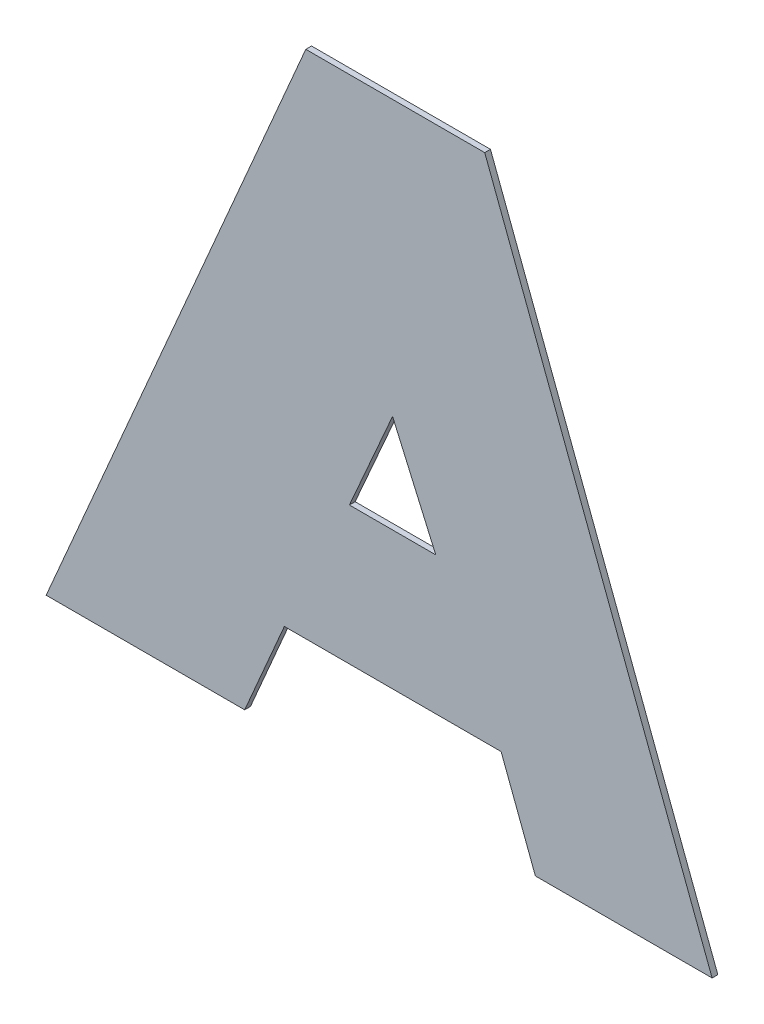
ISO-10303-21;
HEADER;
FILE_DESCRIPTION(('STEP AP214'),'2;1');
FILE_NAME('part.step','',(''),(''),'','','');
FILE_SCHEMA(('AUTOMOTIVE_DESIGN { 1 0 10303 214 1 1 1 1 }'));
ENDSEC;
DATA;
#1=APPLICATION_CONTEXT('core data for automotive mechanical design processes');
#2=APPLICATION_PROTOCOL_DEFINITION('international standard','automotive_design',2000,#1);
#3=PRODUCT_CONTEXT('',#1,'mechanical');
#4=PRODUCT('Part','Part','',(#3));
#5=PRODUCT_RELATED_PRODUCT_CATEGORY('part','',(#4));
#6=PRODUCT_DEFINITION_FORMATION('','',#4);
#7=PRODUCT_DEFINITION_CONTEXT('part definition',#1,'design');
#8=PRODUCT_DEFINITION('design','',#6,#7);
#9=PRODUCT_DEFINITION_SHAPE('','',#8);
#10=(LENGTH_UNIT() NAMED_UNIT(*) SI_UNIT(.MILLI.,.METRE.));
#11=(NAMED_UNIT(*) PLANE_ANGLE_UNIT() SI_UNIT($,.RADIAN.));
#12=(NAMED_UNIT(*) SI_UNIT($,.STERADIAN.) SOLID_ANGLE_UNIT());
#13=UNCERTAINTY_MEASURE_WITH_UNIT(LENGTH_MEASURE(1.E-05),#10,'distance_accuracy_value','');
#14=(GEOMETRIC_REPRESENTATION_CONTEXT(3) GLOBAL_UNCERTAINTY_ASSIGNED_CONTEXT((#13)) GLOBAL_UNIT_ASSIGNED_CONTEXT((#10,
#11,#12)) REPRESENTATION_CONTEXT('',''));
#15=CARTESIAN_POINT('',(0.,0.,0.));
#16=DIRECTION('',(0.,0.,1.));
#17=DIRECTION('',(1.,0.,0.));
#18=AXIS2_PLACEMENT_3D('',#15,#16,#17);
#19=CARTESIAN_POINT('',(0.,1.03768008731782,0.551));
#20=DIRECTION('',(0.,-1.,0.));
#21=DIRECTION('',(0.,0.,-1.));
#22=AXIS2_PLACEMENT_3D('',#19,#20,#21);
#23=PLANE('',#22);
#24=DIRECTION('',(-1.,0.,0.));
#25=VECTOR('',#24,1.);
#26=CARTESIAN_POINT('',(1.05029821951941,1.03768008731782,0.55));
#27=LINE('',#26,#25);
#28=CARTESIAN_POINT('',(1.05029821951941,1.03768008731782,0.55));
#29=VERTEX_POINT('',#28);
#30=CARTESIAN_POINT('',(1.01563203255563,1.03768008731782,0.55));
#31=VERTEX_POINT('',#30);
#32=EDGE_CURVE('E11',#29,#31,#27,.T.);
#33=ORIENTED_EDGE('',*,*,#32,.F.);
#34=DIRECTION('',(0.,0.,-1.));
#35=VECTOR('',#34,1.);
#36=CARTESIAN_POINT('',(1.05029821951941,1.03768008731782,0.551));
#37=LINE('',#36,#35);
#38=CARTESIAN_POINT('',(1.05029821951941,1.03768008731782,0.551));
#39=VERTEX_POINT('',#38);
#40=EDGE_CURVE('E190',#39,#29,#37,.T.);
#41=ORIENTED_EDGE('',*,*,#40,.F.);
#42=DIRECTION('',(-1.,0.,0.));
#43=VECTOR('',#42,1.);
#44=CARTESIAN_POINT('',(1.05029821951941,1.03768008731782,0.551));
#45=LINE('',#44,#43);
#46=CARTESIAN_POINT('',(1.01563203255563,1.03768008731782,0.551));
#47=VERTEX_POINT('',#46);
#48=EDGE_CURVE('E183',#39,#47,#45,.T.);
#49=ORIENTED_EDGE('',*,*,#48,.T.);
#50=DIRECTION('',(0.,0.,-1.));
#51=VECTOR('',#50,1.);
#52=CARTESIAN_POINT('',(1.01563203255563,1.03768008731782,0.551));
#53=LINE('',#52,#51);
#54=EDGE_CURVE('E172',#47,#31,#53,.T.);
#55=ORIENTED_EDGE('',*,*,#54,.T.);
#56=EDGE_LOOP('',(#33,#41,#49,#55));
#57=FACE_BOUND('',#56,.T.);
#58=ADVANCED_FACE('F17',(#57),#23,.T.);
#59=CARTESIAN_POINT('',(0.508733461367942,-0.219202709081923,0.551));
#60=DIRECTION('',(0.918375888718996,-0.395709144473052,0.));
#61=DIRECTION('',(0.395709144473052,0.918375888718996,0.));
#62=AXIS2_PLACEMENT_3D('',#59,#60,#61);
#63=PLANE('',#62);
#64=DIRECTION('',(-0.395709144473054,-0.918375888718995,0.));
#65=VECTOR('',#64,1.);
#66=CARTESIAN_POINT('',(1.05722528503883,1.05375666791109,0.55));
#67=LINE('',#66,#65);
#68=CARTESIAN_POINT('',(1.05722528503883,1.05375666791109,0.55));
#69=VERTEX_POINT('',#68);
#70=EDGE_CURVE('E24',#69,#29,#67,.T.);
#71=ORIENTED_EDGE('',*,*,#70,.F.);
#72=DIRECTION('',(0.,0.,-1.));
#73=VECTOR('',#72,1.);
#74=CARTESIAN_POINT('',(1.05722528503883,1.05375666791109,0.551));
#75=LINE('',#74,#73);
#76=CARTESIAN_POINT('',(1.05722528503883,1.05375666791109,0.551));
#77=VERTEX_POINT('',#76);
#78=EDGE_CURVE('E185',#77,#69,#75,.T.);
#79=ORIENTED_EDGE('',*,*,#78,.F.);
#80=DIRECTION('',(-0.395709144473054,-0.918375888718995,0.));
#81=VECTOR('',#80,1.);
#82=CARTESIAN_POINT('',(1.05722528503883,1.05375666791109,0.551));
#83=LINE('',#82,#81);
#84=EDGE_CURVE('E174',#77,#39,#83,.T.);
#85=ORIENTED_EDGE('',*,*,#84,.T.);
#86=ORIENTED_EDGE('',*,*,#40,.T.);
#87=EDGE_LOOP('',(#71,#79,#85,#86));
#88=FACE_BOUND('',#87,.T.);
#89=ADVANCED_FACE('F205',(#88),#63,.T.);
#90=CARTESIAN_POINT('',(0.,1.0537566679111,0.551));
#91=DIRECTION('',(0.,-1.,0.));
#92=DIRECTION('',(1.,0.,0.));
#93=AXIS2_PLACEMENT_3D('',#90,#91,#92);
#94=PLANE('',#93);
#95=DIRECTION('',(-1.,0.,0.));
#96=VECTOR('',#95,1.);
#97=CARTESIAN_POINT('',(1.09506886804617,1.05375666791109,0.55));
#98=LINE('',#97,#96);
#99=CARTESIAN_POINT('',(1.09506886804617,1.05375666791108,0.55));
#100=VERTEX_POINT('',#99);
#101=EDGE_CURVE('E187',#100,#69,#98,.T.);
#102=ORIENTED_EDGE('',*,*,#101,.F.);
#103=DIRECTION('',(0.,0.,-1.));
#104=VECTOR('',#103,1.);
#105=CARTESIAN_POINT('',(1.09506886804617,1.05375666791108,0.551));
#106=LINE('',#105,#104);
#107=CARTESIAN_POINT('',(1.09506886804617,1.05375666791108,0.551));
#108=VERTEX_POINT('',#107);
#109=EDGE_CURVE('E177',#108,#100,#106,.T.);
#110=ORIENTED_EDGE('',*,*,#109,.F.);
#111=DIRECTION('',(-1.,0.,0.));
#112=VECTOR('',#111,1.);
#113=CARTESIAN_POINT('',(1.09506886804617,1.05375666791109,0.551));
#114=LINE('',#113,#112);
#115=EDGE_CURVE('E163',#108,#77,#114,.T.);
#116=ORIENTED_EDGE('',*,*,#115,.T.);
#117=ORIENTED_EDGE('',*,*,#78,.T.);
#118=EDGE_LOOP('',(#102,#110,#116,#117));
#119=FACE_BOUND('',#118,.T.);
#120=ADVANCED_FACE('F195',(#119),#94,.T.);
#121=CARTESIAN_POINT('',(1.3066986324953,0.494252347521643,0.551));
#122=DIRECTION('',(-0.935327513763568,-0.353783043681946,0.));
#123=DIRECTION('',(0.353783043681946,-0.935327513763568,0.));
#124=AXIS2_PLACEMENT_3D('',#121,#122,#123);
#125=PLANE('',#124);
#126=DIRECTION('',(-0.353783043681943,0.93532751376357,0.));
#127=VECTOR('',#126,1.);
#128=CARTESIAN_POINT('',(1.10105217081462,1.03793808134384,0.55));
#129=LINE('',#128,#127);
#130=CARTESIAN_POINT('',(1.10105217081462,1.03793808134384,0.55));
#131=VERTEX_POINT('',#130);
#132=EDGE_CURVE('E180',#131,#100,#129,.T.);
#133=ORIENTED_EDGE('',*,*,#132,.F.);
#134=DIRECTION('',(0.,-2.22044604925006E-13,-1.));
#135=VECTOR('',#134,1.);
#136=CARTESIAN_POINT('',(1.10105217081462,1.03793808134384,0.551));
#137=LINE('',#136,#135);
#138=CARTESIAN_POINT('',(1.10105217081462,1.03793808134384,0.551));
#139=VERTEX_POINT('',#138);
#140=EDGE_CURVE('E166',#139,#131,#137,.T.);
#141=ORIENTED_EDGE('',*,*,#140,.F.);
#142=DIRECTION('',(-0.353783043681943,0.93532751376357,0.));
#143=VECTOR('',#142,1.);
#144=CARTESIAN_POINT('',(1.10105217081462,1.03793808134384,0.551));
#145=LINE('',#144,#143);
#146=EDGE_CURVE('E154',#139,#108,#145,.T.);
#147=ORIENTED_EDGE('',*,*,#146,.T.);
#148=ORIENTED_EDGE('',*,*,#109,.T.);
#149=EDGE_LOOP('',(#133,#141,#147,#148));
#150=FACE_BOUND('',#149,.T.);
#151=ADVANCED_FACE('F197',(#150),#125,.T.);
#152=CARTESIAN_POINT('',(0.,1.03793808134384,0.551));
#153=DIRECTION('',(0.,-1.,0.));
#154=DIRECTION('',(0.,0.,-1.));
#155=AXIS2_PLACEMENT_3D('',#152,#153,#154);
#156=PLANE('',#155);
#157=DIRECTION('',(-1.,0.,0.));
#158=VECTOR('',#157,1.);
#159=CARTESIAN_POINT('',(1.13191269623935,1.03793808134384,0.55));
#160=LINE('',#159,#158);
#161=CARTESIAN_POINT('',(1.13191269623935,1.03793808134384,0.55));
#162=VERTEX_POINT('',#161);
#163=EDGE_CURVE('E169',#162,#131,#160,.T.);
#164=ORIENTED_EDGE('',*,*,#163,.F.);
#165=DIRECTION('',(0.,-2.22044604925006E-13,-1.));
#166=VECTOR('',#165,1.);
#167=CARTESIAN_POINT('',(1.13191269623935,1.03793808134384,0.551));
#168=LINE('',#167,#166);
#169=CARTESIAN_POINT('',(1.13191269623935,1.03793808134384,0.551));
#170=VERTEX_POINT('',#169);
#171=EDGE_CURVE('E157',#170,#162,#168,.T.);
#172=ORIENTED_EDGE('',*,*,#171,.F.);
#173=DIRECTION('',(-1.,0.,0.));
#174=VECTOR('',#173,1.);
#175=CARTESIAN_POINT('',(1.13191269623935,1.03793808134384,0.551));
#176=LINE('',#175,#174);
#177=EDGE_CURVE('E145',#170,#139,#176,.T.);
#178=ORIENTED_EDGE('',*,*,#177,.T.);
#179=ORIENTED_EDGE('',*,*,#140,.T.);
#180=EDGE_LOOP('',(#164,#172,#178,#179));
#181=FACE_BOUND('',#180,.T.);
#182=ADVANCED_FACE('F217',(#181),#156,.T.);
#183=CARTESIAN_POINT('',(1.33369657919657,0.504464188418624,0.551));
#184=DIRECTION('',(0.935327513763572,0.353783043681937,0.));
#185=DIRECTION('',(-0.353783043681937,0.935327513763572,0.));
#186=AXIS2_PLACEMENT_3D('',#183,#184,#185);
#187=PLANE('',#186);
#188=DIRECTION('',(0.353783043681939,-0.935327513763571,0.));
#189=VECTOR('',#188,1.);
#190=CARTESIAN_POINT('',(1.09221187275809,1.1428986586927,0.55));
#191=LINE('',#190,#189);
#192=CARTESIAN_POINT('',(1.09221187275809,1.1428986586927,0.55));
#193=VERTEX_POINT('',#192);
#194=EDGE_CURVE('E160',#193,#162,#191,.T.);
#195=ORIENTED_EDGE('',*,*,#194,.F.);
#196=DIRECTION('',(0.,-2.22044604925006E-13,-1.));
#197=VECTOR('',#196,1.);
#198=CARTESIAN_POINT('',(1.09221187275809,1.1428986586927,0.551));
#199=LINE('',#198,#197);
#200=CARTESIAN_POINT('',(1.09221187275809,1.1428986586927,0.551));
#201=VERTEX_POINT('',#200);
#202=EDGE_CURVE('E148',#201,#193,#199,.T.);
#203=ORIENTED_EDGE('',*,*,#202,.F.);
#204=DIRECTION('',(0.353783043681939,-0.935327513763571,0.));
#205=VECTOR('',#204,1.);
#206=CARTESIAN_POINT('',(1.09221187275809,1.1428986586927,0.551));
#207=LINE('',#206,#205);
#208=EDGE_CURVE('E137',#201,#170,#207,.T.);
#209=ORIENTED_EDGE('',*,*,#208,.T.);
#210=ORIENTED_EDGE('',*,*,#171,.T.);
#211=EDGE_LOOP('',(#195,#203,#209,#210));
#212=FACE_BOUND('',#211,.T.);
#213=ADVANCED_FACE('F215',(#212),#187,.T.);
#214=CARTESIAN_POINT('',(0.,1.1428986586927,0.551));
#215=DIRECTION('',(0.,1.,0.));
#216=DIRECTION('',(0.,0.,1.));
#217=AXIS2_PLACEMENT_3D('',#214,#215,#216);
#218=PLANE('',#217);
#219=DIRECTION('',(1.,0.,0.));
#220=VECTOR('',#219,1.);
#221=CARTESIAN_POINT('',(1.06096853514991,1.1428986586927,0.55));
#222=LINE('',#221,#220);
#223=CARTESIAN_POINT('',(1.06096853514991,1.1428986586927,0.55));
#224=VERTEX_POINT('',#223);
#225=EDGE_CURVE('E151',#224,#193,#222,.T.);
#226=ORIENTED_EDGE('',*,*,#225,.F.);
#227=DIRECTION('',(0.,-2.22044604925006E-13,-1.));
#228=VECTOR('',#227,1.);
#229=CARTESIAN_POINT('',(1.06096853514991,1.1428986586927,0.551));
#230=LINE('',#229,#228);
#231=CARTESIAN_POINT('',(1.06096853514991,1.1428986586927,0.551));
#232=VERTEX_POINT('',#231);
#233=EDGE_CURVE('E140',#232,#224,#230,.T.);
#234=ORIENTED_EDGE('',*,*,#233,.F.);
#235=DIRECTION('',(1.,0.,0.));
#236=VECTOR('',#235,1.);
#237=CARTESIAN_POINT('',(1.06096853514991,1.1428986586927,0.551));
#238=LINE('',#237,#236);
#239=EDGE_CURVE('E130',#232,#201,#238,.T.);
#240=ORIENTED_EDGE('',*,*,#239,.T.);
#241=ORIENTED_EDGE('',*,*,#202,.T.);
#242=EDGE_LOOP('',(#226,#234,#240,#241));
#243=FACE_BOUND('',#242,.T.);
#244=ADVANCED_FACE('F213',(#243),#218,.T.);
#245=CARTESIAN_POINT('',(0.498977099105884,-0.219145347580263,0.551));
#246=DIRECTION('',(0.915588482621426,-0.402116563313419,0.));
#247=DIRECTION('',(0.402116563313419,0.915588482621426,0.));
#248=AXIS2_PLACEMENT_3D('',#245,#246,#247);
#249=PLANE('',#248);
#250=DIRECTION('',(-0.402116563313421,-0.915588482621425,0.));
#251=VECTOR('',#250,1.);
#252=CARTESIAN_POINT('',(1.0761201152762,1.09496490462305,0.55));
#253=LINE('',#252,#251);
#254=CARTESIAN_POINT('',(1.0761201152762,1.09496490462305,0.55));
#255=VERTEX_POINT('',#254);
#256=CARTESIAN_POINT('',(1.068579889768,1.07779639115823,0.55));
#257=VERTEX_POINT('',#256);
#258=EDGE_CURVE('E143',#255,#257,#253,.T.);
#259=ORIENTED_EDGE('',*,*,#258,.F.);
#260=DIRECTION('',(0.,-2.22044604925006E-13,-1.));
#261=VECTOR('',#260,1.);
#262=CARTESIAN_POINT('',(1.0761201152762,1.09496490462305,0.551));
#263=LINE('',#262,#261);
#264=CARTESIAN_POINT('',(1.0761201152762,1.09496490462305,0.551));
#265=VERTEX_POINT('',#264);
#266=EDGE_CURVE('E102',#265,#255,#263,.T.);
#267=ORIENTED_EDGE('',*,*,#266,.F.);
#268=DIRECTION('',(-0.402116563313421,-0.915588482621425,0.));
#269=VECTOR('',#268,1.);
#270=CARTESIAN_POINT('',(1.0761201152762,1.09496490462305,0.551));
#271=LINE('',#270,#269);
#272=CARTESIAN_POINT('',(1.068579889768,1.07779639115823,0.551));
#273=VERTEX_POINT('',#272);
#274=EDGE_CURVE('E96',#265,#273,#271,.T.);
#275=ORIENTED_EDGE('',*,*,#274,.T.);
#276=DIRECTION('',(-2.22044604925006E-13,0.,-1.));
#277=VECTOR('',#276,1.);
#278=CARTESIAN_POINT('',(1.068579889768,1.07779639115823,0.551));
#279=LINE('',#278,#277);
#280=EDGE_CURVE('E99',#273,#257,#279,.T.);
#281=ORIENTED_EDGE('',*,*,#280,.T.);
#282=EDGE_LOOP('',(#259,#267,#275,#281));
#283=FACE_BOUND('',#282,.T.);
#284=ADVANCED_FACE('F98',(#283),#249,.T.);
#285=CARTESIAN_POINT('',(1.30525077069476,0.573252027670066,0.551));
#286=DIRECTION('',(-0.915588482621392,-0.402116563313497,0.));
#287=DIRECTION('',(0.402116563313497,-0.915588482621392,0.));
#288=AXIS2_PLACEMENT_3D('',#285,#286,#287);
#289=PLANE('',#288);
#290=DIRECTION('',(-0.40211656331349,0.915588482621395,0.));
#291=VECTOR('',#290,1.);
#292=CARTESIAN_POINT('',(1.0836603407844,1.07779639115823,0.55));
#293=LINE('',#292,#291);
#294=CARTESIAN_POINT('',(1.0836603407844,1.07779639115823,0.55));
#295=VERTEX_POINT('',#294);
#296=EDGE_CURVE('E134',#295,#255,#293,.T.);
#297=ORIENTED_EDGE('',*,*,#296,.F.);
#298=DIRECTION('',(0.,0.,-1.));
#299=VECTOR('',#298,1.);
#300=CARTESIAN_POINT('',(1.0836603407844,1.07779639115823,0.551));
#301=LINE('',#300,#299);
#302=CARTESIAN_POINT('',(1.0836603407844,1.07779639115823,0.551));
#303=VERTEX_POINT('',#302);
#304=EDGE_CURVE('E107',#303,#295,#301,.T.);
#305=ORIENTED_EDGE('',*,*,#304,.F.);
#306=DIRECTION('',(-0.40211656331349,0.915588482621395,0.));
#307=VECTOR('',#306,1.);
#308=CARTESIAN_POINT('',(1.0836603407844,1.07779639115823,0.551));
#309=LINE('',#308,#307);
#310=EDGE_CURVE('E117',#303,#265,#309,.T.);
#311=ORIENTED_EDGE('',*,*,#310,.T.);
#312=ORIENTED_EDGE('',*,*,#266,.T.);
#313=EDGE_LOOP('',(#297,#305,#311,#312));
#314=FACE_BOUND('',#313,.T.);
#315=ADVANCED_FACE('F246',(#314),#289,.T.);
#316=CARTESIAN_POINT('',(0.,1.07779639115823,0.551));
#317=DIRECTION('',(0.,1.,0.));
#318=DIRECTION('',(0.,0.,1.));
#319=AXIS2_PLACEMENT_3D('',#316,#317,#318);
#320=PLANE('',#319);
#321=DIRECTION('',(1.,0.,0.));
#322=VECTOR('',#321,1.);
#323=CARTESIAN_POINT('',(1.068579889768,1.07779639115823,0.55));
#324=LINE('',#323,#322);
#325=EDGE_CURVE('E116',#257,#295,#324,.T.);
#326=ORIENTED_EDGE('',*,*,#325,.F.);
#327=ORIENTED_EDGE('',*,*,#280,.F.);
#328=DIRECTION('',(1.,0.,0.));
#329=VECTOR('',#328,1.);
#330=CARTESIAN_POINT('',(1.068579889768,1.07779639115823,0.551));
#331=LINE('',#330,#329);
#332=EDGE_CURVE('E114',#273,#303,#331,.T.);
#333=ORIENTED_EDGE('',*,*,#332,.T.);
#334=ORIENTED_EDGE('',*,*,#304,.T.);
#335=EDGE_LOOP('',(#326,#327,#333,#334));
#336=FACE_BOUND('',#335,.T.);
#337=ADVANCED_FACE('F112',(#336),#320,.T.);
#338=CARTESIAN_POINT('',(0.479495504492882,-0.206604679186663,0.551));
#339=DIRECTION('',(-0.918375888718995,0.395709144473055,0.));
#340=DIRECTION('',(-0.395709144473055,-0.918375888718995,0.));
#341=AXIS2_PLACEMENT_3D('',#338,#339,#340);
#342=PLANE('',#341);
#343=DIRECTION('',(0.395709144473055,0.918375888718995,0.));
#344=VECTOR('',#343,1.);
#345=CARTESIAN_POINT('',(1.01563203255563,1.03768008731782,0.55));
#346=LINE('',#345,#344);
#347=EDGE_CURVE('E108',#31,#224,#346,.T.);
#348=ORIENTED_EDGE('',*,*,#347,.F.);
#349=ORIENTED_EDGE('',*,*,#54,.F.);
#350=DIRECTION('',(0.395709144473055,0.918375888718995,0.));
#351=VECTOR('',#350,1.);
#352=CARTESIAN_POINT('',(1.01563203255563,1.03768008731782,0.551));
#353=LINE('',#352,#351);
#354=EDGE_CURVE('E120',#47,#232,#353,.T.);
#355=ORIENTED_EDGE('',*,*,#354,.T.);
#356=ORIENTED_EDGE('',*,*,#233,.T.);
#357=EDGE_LOOP('',(#348,#349,#355,#356));
#358=FACE_BOUND('',#357,.T.);
#359=ADVANCED_FACE('F209',(#358),#342,.T.);
#360=CARTESIAN_POINT('',(0.,0.,0.551));
#361=DIRECTION('',(0.,0.,1.));
#362=DIRECTION('',(1.,0.,0.));
#363=AXIS2_PLACEMENT_3D('',#360,#361,#362);
#364=PLANE('',#363);
#365=ORIENTED_EDGE('',*,*,#48,.F.);
#366=ORIENTED_EDGE('',*,*,#84,.F.);
#367=ORIENTED_EDGE('',*,*,#115,.F.);
#368=ORIENTED_EDGE('',*,*,#146,.F.);
#369=ORIENTED_EDGE('',*,*,#177,.F.);
#370=ORIENTED_EDGE('',*,*,#208,.F.);
#371=ORIENTED_EDGE('',*,*,#239,.F.);
#372=ORIENTED_EDGE('',*,*,#354,.F.);
#373=EDGE_LOOP('',(#365,#366,#367,#368,#369,#370,#371,#372));
#374=FACE_BOUND('',#373,.T.);
#375=ORIENTED_EDGE('',*,*,#274,.F.);
#376=ORIENTED_EDGE('',*,*,#310,.F.);
#377=ORIENTED_EDGE('',*,*,#332,.F.);
#378=EDGE_LOOP('',(#375,#376,#377));
#379=FACE_BOUND('',#378,.T.);
#380=ADVANCED_FACE('F119',(#374,#379),#364,.T.);
#381=CARTESIAN_POINT('',(0.,0.,0.55));
#382=DIRECTION('',(0.,0.,1.));
#383=DIRECTION('',(1.,0.,0.));
#384=AXIS2_PLACEMENT_3D('',#381,#382,#383);
#385=PLANE('',#384);
#386=ORIENTED_EDGE('',*,*,#32,.T.);
#387=ORIENTED_EDGE('',*,*,#347,.T.);
#388=ORIENTED_EDGE('',*,*,#225,.T.);
#389=ORIENTED_EDGE('',*,*,#194,.T.);
#390=ORIENTED_EDGE('',*,*,#163,.T.);
#391=ORIENTED_EDGE('',*,*,#132,.T.);
#392=ORIENTED_EDGE('',*,*,#101,.T.);
#393=ORIENTED_EDGE('',*,*,#70,.T.);
#394=EDGE_LOOP('',(#386,#387,#388,#389,#390,#391,#392,#393));
#395=FACE_BOUND('',#394,.T.);
#396=ORIENTED_EDGE('',*,*,#258,.T.);
#397=ORIENTED_EDGE('',*,*,#325,.T.);
#398=ORIENTED_EDGE('',*,*,#296,.T.);
#399=EDGE_LOOP('',(#396,#397,#398));
#400=FACE_BOUND('',#399,.T.);
#401=ADVANCED_FACE('F192',(#395,#400),#385,.F.);
#402=CLOSED_SHELL('',(#58,#89,#120,#151,#182,#213,#244,#284,#315,#337,#359,#380,#401));
#403=MANIFOLD_SOLID_BREP('B1',#402);
#404=ADVANCED_BREP_SHAPE_REPRESENTATION('',(#18,#403),#14);
#405=SHAPE_DEFINITION_REPRESENTATION(#9,#404);
ENDSEC;
END-ISO-10303-21;
